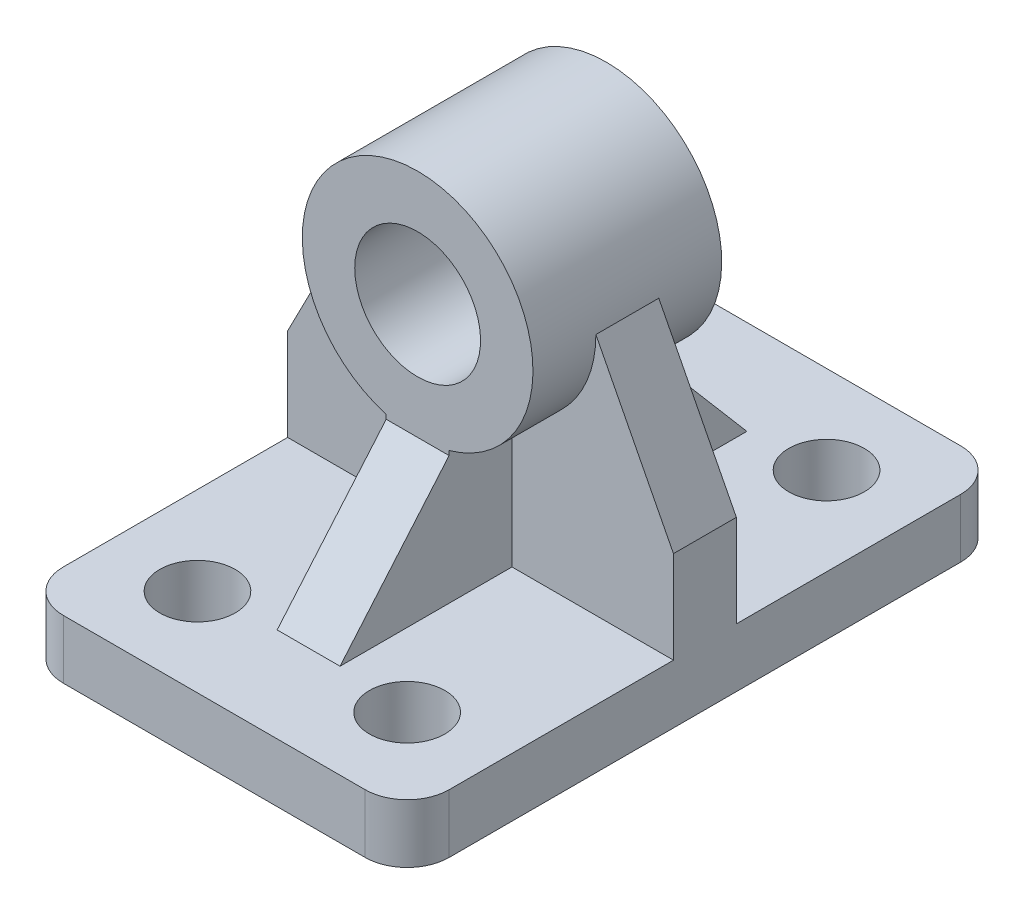
ISO-10303-21;
HEADER;
FILE_DESCRIPTION(('STEP AP214'),'2;1');
FILE_NAME('part.step','',(''),(''),'','','');
FILE_SCHEMA(('AUTOMOTIVE_DESIGN { 1 0 10303 214 1 1 1 1 }'));
ENDSEC;
DATA;
#1=APPLICATION_CONTEXT('core data for automotive mechanical design processes');
#2=APPLICATION_PROTOCOL_DEFINITION('international standard','automotive_design',2000,#1);
#3=PRODUCT_CONTEXT('',#1,'mechanical');
#4=PRODUCT('Part','Part','',(#3));
#5=PRODUCT_RELATED_PRODUCT_CATEGORY('part','',(#4));
#6=PRODUCT_DEFINITION_FORMATION('','',#4);
#7=PRODUCT_DEFINITION_CONTEXT('part definition',#1,'design');
#8=PRODUCT_DEFINITION('design','',#6,#7);
#9=PRODUCT_DEFINITION_SHAPE('','',#8);
#10=(LENGTH_UNIT() NAMED_UNIT(*) SI_UNIT(.MILLI.,.METRE.));
#11=(NAMED_UNIT(*) PLANE_ANGLE_UNIT() SI_UNIT($,.RADIAN.));
#12=(NAMED_UNIT(*) SI_UNIT($,.STERADIAN.) SOLID_ANGLE_UNIT());
#13=UNCERTAINTY_MEASURE_WITH_UNIT(LENGTH_MEASURE(1.E-05),#10,'distance_accuracy_value','');
#14=(GEOMETRIC_REPRESENTATION_CONTEXT(3) GLOBAL_UNCERTAINTY_ASSIGNED_CONTEXT((#13)) GLOBAL_UNIT_ASSIGNED_CONTEXT((#10,
#11,#12)) REPRESENTATION_CONTEXT('',''));
#15=CARTESIAN_POINT('',(0.,0.,0.));
#16=DIRECTION('',(0.,0.,1.));
#17=DIRECTION('',(1.,0.,0.));
#18=AXIS2_PLACEMENT_3D('',#15,#16,#17);
#19=CARTESIAN_POINT('',(-111.401360544218,100.,-85.360544217687));
#20=DIRECTION('',(1.,0.,0.));
#21=DIRECTION('',(0.,0.,-1.));
#22=AXIS2_PLACEMENT_3D('',#19,#20,#21);
#23=PLANE('',#22);
#24=DIRECTION('',(0.,0.,-1.));
#25=VECTOR('',#24,1.);
#26=CARTESIAN_POINT('',(-111.401360544218,14.,-85.3605442176871));
#27=LINE('',#26,#25);
#28=CARTESIAN_POINT('',(-111.401360544218,14.,-21.860544217687));
#29=VERTEX_POINT('',#28);
#30=CARTESIAN_POINT('',(-111.401360544218,14.,-75.360544217687));
#31=VERTEX_POINT('',#30);
#32=EDGE_CURVE('E396',#29,#31,#27,.T.);
#33=ORIENTED_EDGE('',*,*,#32,.T.);
#34=DIRECTION('',(0.,-1.,0.));
#35=VECTOR('',#34,1.);
#36=CARTESIAN_POINT('',(-111.401360544218,100.,-75.360544217687));
#37=LINE('',#36,#35);
#38=CARTESIAN_POINT('',(-111.401360544218,0.,-75.360544217687));
#39=VERTEX_POINT('',#38);
#40=EDGE_CURVE('E322',#31,#39,#37,.T.);
#41=ORIENTED_EDGE('',*,*,#40,.T.);
#42=DIRECTION('',(0.,0.,1.));
#43=VECTOR('',#42,1.);
#44=CARTESIAN_POINT('',(-111.401360544218,0.,-85.360544217687));
#45=LINE('',#44,#43);
#46=CARTESIAN_POINT('',(-111.401360544218,0.,46.6394557823129));
#47=VERTEX_POINT('',#46);
#48=EDGE_CURVE('E278',#39,#47,#45,.T.);
#49=ORIENTED_EDGE('',*,*,#48,.T.);
#50=DIRECTION('',(0.,-1.,0.));
#51=VECTOR('',#50,1.);
#52=CARTESIAN_POINT('',(-111.401360544218,100.,46.6394557823129));
#53=LINE('',#52,#51);
#54=CARTESIAN_POINT('',(-111.401360544218,14.,46.6394557823129));
#55=VERTEX_POINT('',#54);
#56=EDGE_CURVE('E319',#47,#55,#53,.F.);
#57=ORIENTED_EDGE('',*,*,#56,.T.);
#58=DIRECTION('',(0.,0.,-1.));
#59=VECTOR('',#58,1.);
#60=CARTESIAN_POINT('',(-111.401360544218,14.,56.639455782313));
#61=LINE('',#60,#59);
#62=CARTESIAN_POINT('',(-111.401360544218,14.,-6.86054421768706));
#63=VERTEX_POINT('',#62);
#64=EDGE_CURVE('E379',#55,#63,#61,.T.);
#65=ORIENTED_EDGE('',*,*,#64,.T.);
#66=DIRECTION('',(0.,1.,0.));
#67=VECTOR('',#66,1.);
#68=CARTESIAN_POINT('',(-111.401360544218,0.,-6.86054421768706));
#69=LINE('',#68,#67);
#70=CARTESIAN_POINT('',(-111.401360544218,36.,-6.86054421768706));
#71=VERTEX_POINT('',#70);
#72=EDGE_CURVE('E465',#63,#71,#69,.T.);
#73=ORIENTED_EDGE('',*,*,#72,.T.);
#74=DIRECTION('',(0.,0.,1.));
#75=VECTOR('',#74,1.);
#76=CARTESIAN_POINT('',(-111.401360544218,36.,-85.360544217687));
#77=LINE('',#76,#75);
#78=CARTESIAN_POINT('',(-111.401360544218,36.,-21.860544217687));
#79=VERTEX_POINT('',#78);
#80=EDGE_CURVE('E254',#79,#71,#77,.T.);
#81=ORIENTED_EDGE('',*,*,#80,.F.);
#82=DIRECTION('',(0.,1.,0.));
#83=VECTOR('',#82,1.);
#84=CARTESIAN_POINT('',(-111.401360544218,0.,-21.860544217687));
#85=LINE('',#84,#83);
#86=EDGE_CURVE('E867',#29,#79,#85,.T.);
#87=ORIENTED_EDGE('',*,*,#86,.F.);
#88=EDGE_LOOP('',(#33,#41,#49,#57,#65,#73,#81,#87));
#89=FACE_BOUND('',#88,.T.);
#90=ADVANCED_FACE('F59',(#89),#23,.F.);
#91=CARTESIAN_POINT('',(-19.4013605442177,100.,-85.360544217687));
#92=DIRECTION('',(-1.,0.,0.));
#93=DIRECTION('',(0.,0.,1.));
#94=AXIS2_PLACEMENT_3D('',#91,#92,#93);
#95=PLANE('',#94);
#96=DIRECTION('',(0.,0.,-1.));
#97=VECTOR('',#96,1.);
#98=CARTESIAN_POINT('',(-19.4013605442177,0.,-85.360544217687));
#99=LINE('',#98,#97);
#100=CARTESIAN_POINT('',(-19.4013605442176,0.,46.6394557823129));
#101=VERTEX_POINT('',#100);
#102=CARTESIAN_POINT('',(-19.4013605442177,0.,-75.360544217687));
#103=VERTEX_POINT('',#102);
#104=EDGE_CURVE('E285',#101,#103,#99,.T.);
#105=ORIENTED_EDGE('',*,*,#104,.T.);
#106=DIRECTION('',(0.,-1.,0.));
#107=VECTOR('',#106,1.);
#108=CARTESIAN_POINT('',(-19.4013605442177,100.,-75.360544217687));
#109=LINE('',#108,#107);
#110=CARTESIAN_POINT('',(-19.4013605442177,14.,-75.360544217687));
#111=VERTEX_POINT('',#110);
#112=EDGE_CURVE('E355',#103,#111,#109,.F.);
#113=ORIENTED_EDGE('',*,*,#112,.T.);
#114=DIRECTION('',(0.,0.,-1.));
#115=VECTOR('',#114,1.);
#116=CARTESIAN_POINT('',(-19.4013605442177,14.,-85.3605442176871));
#117=LINE('',#116,#115);
#118=CARTESIAN_POINT('',(-19.4013605442177,14.,-21.860544217687));
#119=VERTEX_POINT('',#118);
#120=EDGE_CURVE('E413',#119,#111,#117,.T.);
#121=ORIENTED_EDGE('',*,*,#120,.F.);
#122=DIRECTION('',(0.,1.,0.));
#123=VECTOR('',#122,1.);
#124=CARTESIAN_POINT('',(-19.4013605442177,0.,-21.860544217687));
#125=LINE('',#124,#123);
#126=CARTESIAN_POINT('',(-19.4013605442177,36.,-21.860544217687));
#127=VERTEX_POINT('',#126);
#128=EDGE_CURVE('E243',#119,#127,#125,.T.);
#129=ORIENTED_EDGE('',*,*,#128,.T.);
#130=DIRECTION('',(0.,0.,1.));
#131=VECTOR('',#130,1.);
#132=CARTESIAN_POINT('',(-19.4013605442176,36.,-85.360544217687));
#133=LINE('',#132,#131);
#134=CARTESIAN_POINT('',(-19.4013605442176,36.,-6.86054421768706));
#135=VERTEX_POINT('',#134);
#136=EDGE_CURVE('E241',#127,#135,#133,.T.);
#137=ORIENTED_EDGE('',*,*,#136,.T.);
#138=DIRECTION('',(0.,1.,0.));
#139=VECTOR('',#138,1.);
#140=CARTESIAN_POINT('',(-19.4013605442176,0.,-6.86054421768706));
#141=LINE('',#140,#139);
#142=CARTESIAN_POINT('',(-19.4013605442176,14.,-6.86054421768706));
#143=VERTEX_POINT('',#142);
#144=EDGE_CURVE('E377',#143,#135,#141,.T.);
#145=ORIENTED_EDGE('',*,*,#144,.F.);
#146=DIRECTION('',(0.,0.,-1.));
#147=VECTOR('',#146,1.);
#148=CARTESIAN_POINT('',(-19.4013605442176,14.,56.6394557823129));
#149=LINE('',#148,#147);
#150=CARTESIAN_POINT('',(-19.4013605442176,14.,46.6394557823129));
#151=VERTEX_POINT('',#150);
#152=EDGE_CURVE('E367',#151,#143,#149,.T.);
#153=ORIENTED_EDGE('',*,*,#152,.F.);
#154=DIRECTION('',(0.,-1.,0.));
#155=VECTOR('',#154,1.);
#156=CARTESIAN_POINT('',(-19.4013605442176,100.,46.6394557823129));
#157=LINE('',#156,#155);
#158=EDGE_CURVE('E351',#151,#101,#157,.T.);
#159=ORIENTED_EDGE('',*,*,#158,.T.);
#160=EDGE_LOOP('',(#105,#113,#121,#129,#137,#145,#153,#159));
#161=FACE_BOUND('',#160,.T.);
#162=ADVANCED_FACE('F374',(#161),#95,.F.);
#163=CARTESIAN_POINT('',(-102.763414170796,52.8089767266589,-85.360544217687));
#164=DIRECTION('',(-0.889431307788423,0.457068866502384,0.));
#165=DIRECTION('',(-0.457068866502385,-0.889431307788424,0.));
#166=AXIS2_PLACEMENT_3D('',#163,#164,#165);
#167=PLANE('',#166);
#168=DIRECTION('',(0.,0.,1.));
#169=VECTOR('',#168,1.);
#170=CARTESIAN_POINT('',(-92.9013605442177,72.,-85.360544217687));
#171=LINE('',#170,#169);
#172=CARTESIAN_POINT('',(-92.9013605442176,72.,-21.860544217687));
#173=VERTEX_POINT('',#172);
#174=CARTESIAN_POINT('',(-92.9013605442176,72.,-6.86054421768706));
#175=VERTEX_POINT('',#174);
#176=EDGE_CURVE('E266',#173,#175,#171,.T.);
#177=ORIENTED_EDGE('',*,*,#176,.F.);
#178=DIRECTION('',(0.457068866502385,0.889431307788424,0.));
#179=VECTOR('',#178,1.);
#180=CARTESIAN_POINT('',(-102.763414170796,52.8089767266589,-21.860544217687));
#181=LINE('',#180,#179);
#182=EDGE_CURVE('E458',#79,#173,#181,.T.);
#183=ORIENTED_EDGE('',*,*,#182,.F.);
#184=ORIENTED_EDGE('',*,*,#80,.T.);
#185=DIRECTION('',(0.457068866502385,0.889431307788424,0.));
#186=VECTOR('',#185,1.);
#187=CARTESIAN_POINT('',(-102.763414170796,52.808976726659,-6.86054421768706));
#188=LINE('',#187,#186);
#189=EDGE_CURVE('E456',#71,#175,#188,.T.);
#190=ORIENTED_EDGE('',*,*,#189,.T.);
#191=EDGE_LOOP('',(#177,#183,#184,#190));
#192=FACE_BOUND('',#191,.T.);
#193=ADVANCED_FACE('F455',(#192),#167,.T.);
#194=CARTESIAN_POINT('',(-0.713055556420601,-0.366431327605031,-85.360544217687));
#195=DIRECTION('',(0.889431307788423,0.457068866502385,0.));
#196=DIRECTION('',(-0.457068866502385,0.889431307788424,0.));
#197=AXIS2_PLACEMENT_3D('',#194,#195,#196);
#198=PLANE('',#197);
#199=ORIENTED_EDGE('',*,*,#136,.F.);
#200=DIRECTION('',(-0.457068866502385,0.889431307788424,0.));
#201=VECTOR('',#200,1.);
#202=CARTESIAN_POINT('',(-0.713055556420604,-0.366431327605033,-21.860544217687));
#203=LINE('',#202,#201);
#204=CARTESIAN_POINT('',(-37.9013605442177,72.,-21.860544217687));
#205=VERTEX_POINT('',#204);
#206=EDGE_CURVE('E224',#127,#205,#203,.T.);
#207=ORIENTED_EDGE('',*,*,#206,.T.);
#208=DIRECTION('',(0.,0.,1.));
#209=VECTOR('',#208,1.);
#210=CARTESIAN_POINT('',(-37.9013605442177,72.,-85.360544217687));
#211=LINE('',#210,#209);
#212=CARTESIAN_POINT('',(-37.9013605442177,72.,-6.86054421768706));
#213=VERTEX_POINT('',#212);
#214=EDGE_CURVE('E239',#205,#213,#211,.T.);
#215=ORIENTED_EDGE('',*,*,#214,.T.);
#216=DIRECTION('',(-0.457068866502385,0.889431307788423,0.));
#217=VECTOR('',#216,1.);
#218=CARTESIAN_POINT('',(-0.713055556420598,-0.36643132760503,-6.86054421768706));
#219=LINE('',#218,#217);
#220=EDGE_CURVE('E501',#135,#213,#219,.T.);
#221=ORIENTED_EDGE('',*,*,#220,.F.);
#222=EDGE_LOOP('',(#199,#207,#215,#221));
#223=FACE_BOUND('',#222,.T.);
#224=ADVANCED_FACE('F237',(#223),#198,.T.);
#225=CARTESIAN_POINT('',(-90.4013605442177,100.,-64.360544217687));
#226=DIRECTION('',(0.,-1.,0.));
#227=DIRECTION('',(0.,0.,-1.));
#228=AXIS2_PLACEMENT_3D('',#225,#226,#227);
#229=CYLINDRICAL_SURFACE('',#228,8.99999999999999);
#230=CARTESIAN_POINT('',(-90.4013605442177,0.,-64.360544217687));
#231=DIRECTION('',(0.,1.,0.));
#232=DIRECTION('',(0.,0.,1.));
#233=AXIS2_PLACEMENT_3D('',#230,#231,#232);
#234=CIRCLE('',#233,8.99999999999999);
#235=CARTESIAN_POINT('',(-90.4013605442177,0.,-55.360544217687));
#236=VERTEX_POINT('',#235);
#237=EDGE_CURVE('E274',#236,#236,#234,.T.);
#238=ORIENTED_EDGE('',*,*,#237,.F.);
#239=EDGE_LOOP('',(#238));
#240=FACE_BOUND('',#239,.T.);
#241=CARTESIAN_POINT('',(-90.4013605442177,14.,-64.360544217687));
#242=DIRECTION('',(0.,-1.,0.));
#243=DIRECTION('',(0.,0.,-1.));
#244=AXIS2_PLACEMENT_3D('',#241,#242,#243);
#245=CIRCLE('',#244,8.99999999999999);
#246=CARTESIAN_POINT('',(-90.4013605442177,14.,-73.360544217687));
#247=VERTEX_POINT('',#246);
#248=EDGE_CURVE('E250',#247,#247,#245,.T.);
#249=ORIENTED_EDGE('',*,*,#248,.F.);
#250=EDGE_LOOP('',(#249));
#251=FACE_BOUND('',#250,.T.);
#252=ADVANCED_FACE('F645',(#240,#251),#229,.F.);
#253=CARTESIAN_POINT('',(-40.4013605442177,100.,-64.360544217687));
#254=DIRECTION('',(0.,-1.,0.));
#255=DIRECTION('',(0.,0.,-1.));
#256=AXIS2_PLACEMENT_3D('',#253,#254,#255);
#257=CYLINDRICAL_SURFACE('',#256,9.00000000000001);
#258=CARTESIAN_POINT('',(-40.4013605442177,0.,-64.360544217687));
#259=DIRECTION('',(0.,1.,0.));
#260=DIRECTION('',(0.,0.,1.));
#261=AXIS2_PLACEMENT_3D('',#258,#259,#260);
#262=CIRCLE('',#261,9.00000000000001);
#263=CARTESIAN_POINT('',(-40.4013605442177,0.,-55.360544217687));
#264=VERTEX_POINT('',#263);
#265=EDGE_CURVE('E265',#264,#264,#262,.T.);
#266=ORIENTED_EDGE('',*,*,#265,.F.);
#267=EDGE_LOOP('',(#266));
#268=FACE_BOUND('',#267,.T.);
#269=CARTESIAN_POINT('',(-40.4013605442177,14.,-64.360544217687));
#270=DIRECTION('',(0.,-1.,0.));
#271=DIRECTION('',(0.,0.,-1.));
#272=AXIS2_PLACEMENT_3D('',#269,#270,#271);
#273=CIRCLE('',#272,9.00000000000001);
#274=CARTESIAN_POINT('',(-40.4013605442177,14.,-73.360544217687));
#275=VERTEX_POINT('',#274);
#276=EDGE_CURVE('E308',#275,#275,#273,.T.);
#277=ORIENTED_EDGE('',*,*,#276,.F.);
#278=EDGE_LOOP('',(#277));
#279=FACE_BOUND('',#278,.T.);
#280=ADVANCED_FACE('F652',(#268,#279),#257,.F.);
#281=CARTESIAN_POINT('',(-111.401360544218,44.5,-36.8605442176871));
#282=DIRECTION('',(0.,0.,1.));
#283=DIRECTION('',(0.,-1.,0.));
#284=AXIS2_PLACEMENT_3D('',#281,#282,#283);
#285=PLANE('',#284);
#286=CARTESIAN_POINT('',(-65.4013605442177,72.,-36.8605442176871));
#287=DIRECTION('',(0.,0.,1.));
#288=DIRECTION('',(0.,-1.,0.));
#289=AXIS2_PLACEMENT_3D('',#286,#287,#288);
#290=CIRCLE('',#289,15.);
#291=CARTESIAN_POINT('',(-65.4013605442177,57.,-36.8605442176871));
#292=VERTEX_POINT('',#291);
#293=EDGE_CURVE('E294',#292,#292,#290,.F.);
#294=ORIENTED_EDGE('',*,*,#293,.F.);
#295=EDGE_LOOP('',(#294));
#296=FACE_BOUND('',#295,.T.);
#297=CARTESIAN_POINT('',(-65.4013605442177,72.,-36.8605442176871));
#298=DIRECTION('',(0.,0.,1.));
#299=DIRECTION('',(0.,-1.,0.));
#300=AXIS2_PLACEMENT_3D('',#297,#298,#299);
#301=CIRCLE('',#300,27.5);
#302=CARTESIAN_POINT('',(-72.9013605442177,45.5424868893541,-36.8605442176871));
#303=VERTEX_POINT('',#302);
#304=CARTESIAN_POINT('',(-57.9013605442177,45.5424868893541,-36.8605442176871));
#305=VERTEX_POINT('',#304);
#306=EDGE_CURVE('E298',#303,#305,#301,.F.);
#307=ORIENTED_EDGE('',*,*,#306,.T.);
#308=DIRECTION('',(0.,1.,0.));
#309=VECTOR('',#308,1.);
#310=CARTESIAN_POINT('',(-57.9013605442177,44.5,-36.8605442176871));
#311=LINE('',#310,#309);
#312=CARTESIAN_POINT('',(-57.9013605442177,44.5,-36.8605442176871));
#313=VERTEX_POINT('',#312);
#314=EDGE_CURVE('E492',#313,#305,#311,.T.);
#315=ORIENTED_EDGE('',*,*,#314,.F.);
#316=DIRECTION('',(1.,0.,0.));
#317=VECTOR('',#316,1.);
#318=CARTESIAN_POINT('',(-111.401360544218,44.5,-36.8605442176871));
#319=LINE('',#318,#317);
#320=CARTESIAN_POINT('',(-72.9013605442177,44.5,-36.8605442176871));
#321=VERTEX_POINT('',#320);
#322=EDGE_CURVE('E434',#321,#313,#319,.T.);
#323=ORIENTED_EDGE('',*,*,#322,.F.);
#324=DIRECTION('',(0.,1.,0.));
#325=VECTOR('',#324,1.);
#326=CARTESIAN_POINT('',(-72.9013605442177,44.5,-36.8605442176871));
#327=LINE('',#326,#325);
#328=EDGE_CURVE('E841',#321,#303,#327,.T.);
#329=ORIENTED_EDGE('',*,*,#328,.T.);
#330=EDGE_LOOP('',(#307,#315,#323,#329));
#331=FACE_BOUND('',#330,.T.);
#332=ADVANCED_FACE('F660',(#296,#331),#285,.F.);
#333=CARTESIAN_POINT('',(-111.401360544218,14.,-62.860544217687));
#334=DIRECTION('',(0.,-0.648734176013878,0.761015091093202));
#335=DIRECTION('',(0.,-0.761015091093203,-0.648734176013878));
#336=AXIS2_PLACEMENT_3D('',#333,#334,#335);
#337=PLANE('',#336);
#338=DIRECTION('',(0.,0.761015091093203,0.648734176013878));
#339=VECTOR('',#338,1.);
#340=CARTESIAN_POINT('',(-57.9013605442177,14.,-62.860544217687));
#341=LINE('',#340,#339);
#342=CARTESIAN_POINT('',(-57.9013605442177,14.,-62.860544217687));
#343=VERTEX_POINT('',#342);
#344=EDGE_CURVE('E316',#343,#313,#341,.T.);
#345=ORIENTED_EDGE('',*,*,#344,.F.);
#346=DIRECTION('',(1.,0.,0.));
#347=VECTOR('',#346,1.);
#348=CARTESIAN_POINT('',(-111.401360544218,14.,-62.860544217687));
#349=LINE('',#348,#347);
#350=CARTESIAN_POINT('',(-72.9013605442177,14.,-62.860544217687));
#351=VERTEX_POINT('',#350);
#352=EDGE_CURVE('E380',#351,#343,#349,.T.);
#353=ORIENTED_EDGE('',*,*,#352,.F.);
#354=DIRECTION('',(0.,0.761015091093203,0.648734176013878));
#355=VECTOR('',#354,1.);
#356=CARTESIAN_POINT('',(-72.9013605442177,14.,-62.860544217687));
#357=LINE('',#356,#355);
#358=EDGE_CURVE('E312',#351,#321,#357,.T.);
#359=ORIENTED_EDGE('',*,*,#358,.T.);
#360=ORIENTED_EDGE('',*,*,#322,.T.);
#361=EDGE_LOOP('',(#345,#353,#359,#360));
#362=FACE_BOUND('',#361,.T.);
#363=ADVANCED_FACE('F668',(#362),#337,.F.);
#364=CARTESIAN_POINT('',(-90.4013605442176,100.,35.6394557823129));
#365=DIRECTION('',(0.,-1.,0.));
#366=DIRECTION('',(0.,0.,-1.));
#367=AXIS2_PLACEMENT_3D('',#364,#365,#366);
#368=CYLINDRICAL_SURFACE('',#367,9.);
#369=CARTESIAN_POINT('',(-90.4013605442176,0.,35.6394557823129));
#370=DIRECTION('',(0.,1.,0.));
#371=DIRECTION('',(0.,0.,1.));
#372=AXIS2_PLACEMENT_3D('',#369,#370,#371);
#373=CIRCLE('',#372,9.);
#374=CARTESIAN_POINT('',(-90.4013605442176,0.,44.6394557823129));
#375=VERTEX_POINT('',#374);
#376=EDGE_CURVE('E270',#375,#375,#373,.T.);
#377=ORIENTED_EDGE('',*,*,#376,.F.);
#378=EDGE_LOOP('',(#377));
#379=FACE_BOUND('',#378,.T.);
#380=CARTESIAN_POINT('',(-90.4013605442176,14.,35.6394557823129));
#381=DIRECTION('',(0.,-1.,0.));
#382=DIRECTION('',(0.,0.,-1.));
#383=AXIS2_PLACEMENT_3D('',#380,#381,#382);
#384=CIRCLE('',#383,9.);
#385=CARTESIAN_POINT('',(-90.4013605442176,14.,26.6394557823129));
#386=VERTEX_POINT('',#385);
#387=EDGE_CURVE('E257',#386,#386,#384,.T.);
#388=ORIENTED_EDGE('',*,*,#387,.F.);
#389=EDGE_LOOP('',(#388));
#390=FACE_BOUND('',#389,.T.);
#391=ADVANCED_FACE('F676',(#379,#390),#368,.F.);
#392=CARTESIAN_POINT('',(-40.4013605442177,100.,35.6394557823129));
#393=DIRECTION('',(0.,-1.,0.));
#394=DIRECTION('',(0.,0.,-1.));
#395=AXIS2_PLACEMENT_3D('',#392,#393,#394);
#396=CYLINDRICAL_SURFACE('',#395,9.);
#397=CARTESIAN_POINT('',(-40.4013605442177,0.,35.6394557823129));
#398=DIRECTION('',(0.,1.,0.));
#399=DIRECTION('',(0.,0.,1.));
#400=AXIS2_PLACEMENT_3D('',#397,#398,#399);
#401=CIRCLE('',#400,9.);
#402=CARTESIAN_POINT('',(-40.4013605442177,0.,44.6394557823129));
#403=VERTEX_POINT('',#402);
#404=EDGE_CURVE('E261',#403,#403,#401,.T.);
#405=ORIENTED_EDGE('',*,*,#404,.F.);
#406=EDGE_LOOP('',(#405));
#407=FACE_BOUND('',#406,.T.);
#408=CARTESIAN_POINT('',(-40.4013605442177,14.,35.6394557823129));
#409=DIRECTION('',(0.,-1.,0.));
#410=DIRECTION('',(0.,0.,-1.));
#411=AXIS2_PLACEMENT_3D('',#408,#409,#410);
#412=CIRCLE('',#411,9.);
#413=CARTESIAN_POINT('',(-40.4013605442177,14.,26.6394557823129));
#414=VERTEX_POINT('',#413);
#415=EDGE_CURVE('E293',#414,#414,#412,.T.);
#416=ORIENTED_EDGE('',*,*,#415,.F.);
#417=EDGE_LOOP('',(#416));
#418=FACE_BOUND('',#417,.T.);
#419=ADVANCED_FACE('F685',(#407,#418),#396,.F.);
#420=CARTESIAN_POINT('',(-111.401360544218,44.5,8.13945578231296));
#421=DIRECTION('',(0.,0.,-1.));
#422=DIRECTION('',(-1.,0.,0.));
#423=AXIS2_PLACEMENT_3D('',#420,#421,#422);
#424=PLANE('',#423);
#425=CARTESIAN_POINT('',(-65.4013605442177,72.,8.13945578231295));
#426=DIRECTION('',(0.,0.,-1.));
#427=DIRECTION('',(-1.,0.,0.));
#428=AXIS2_PLACEMENT_3D('',#425,#426,#427);
#429=CIRCLE('',#428,15.);
#430=CARTESIAN_POINT('',(-80.4013605442177,72.,8.13945578231296));
#431=VERTEX_POINT('',#430);
#432=EDGE_CURVE('E300',#431,#431,#429,.F.);
#433=ORIENTED_EDGE('',*,*,#432,.F.);
#434=EDGE_LOOP('',(#433));
#435=FACE_BOUND('',#434,.T.);
#436=CARTESIAN_POINT('',(-65.4013605442177,72.,8.13945578231295));
#437=DIRECTION('',(0.,0.,-1.));
#438=DIRECTION('',(-1.,0.,0.));
#439=AXIS2_PLACEMENT_3D('',#436,#437,#438);
#440=CIRCLE('',#439,27.5);
#441=CARTESIAN_POINT('',(-57.9013605442177,45.5424868893541,8.13945578231295));
#442=VERTEX_POINT('',#441);
#443=CARTESIAN_POINT('',(-72.9013605442177,45.5424868893541,8.13945578231295));
#444=VERTEX_POINT('',#443);
#445=EDGE_CURVE('E304',#442,#444,#440,.F.);
#446=ORIENTED_EDGE('',*,*,#445,.T.);
#447=DIRECTION('',(0.,1.,0.));
#448=VECTOR('',#447,1.);
#449=CARTESIAN_POINT('',(-72.9013605442176,44.5,8.13945578231295));
#450=LINE('',#449,#448);
#451=CARTESIAN_POINT('',(-72.9013605442177,44.5,8.13945578231295));
#452=VERTEX_POINT('',#451);
#453=EDGE_CURVE('E421',#452,#444,#450,.T.);
#454=ORIENTED_EDGE('',*,*,#453,.F.);
#455=DIRECTION('',(1.,0.,0.));
#456=VECTOR('',#455,1.);
#457=CARTESIAN_POINT('',(-111.401360544218,44.5,8.13945578231296));
#458=LINE('',#457,#456);
#459=CARTESIAN_POINT('',(-57.9013605442177,44.5,8.13945578231295));
#460=VERTEX_POINT('',#459);
#461=EDGE_CURVE('E299',#452,#460,#458,.T.);
#462=ORIENTED_EDGE('',*,*,#461,.T.);
#463=DIRECTION('',(0.,1.,0.));
#464=VECTOR('',#463,1.);
#465=CARTESIAN_POINT('',(-57.9013605442177,44.5,8.13945578231295));
#466=LINE('',#465,#464);
#467=EDGE_CURVE('E515',#460,#442,#466,.T.);
#468=ORIENTED_EDGE('',*,*,#467,.T.);
#469=EDGE_LOOP('',(#446,#454,#462,#468));
#470=FACE_BOUND('',#469,.T.);
#471=ADVANCED_FACE('F694',(#435,#470),#424,.F.);
#472=CARTESIAN_POINT('',(-111.401360544218,14.,34.1394557823129));
#473=DIRECTION('',(0.,-0.648734176013878,-0.761015091093203));
#474=DIRECTION('',(0.,0.761015091093203,-0.648734176013878));
#475=AXIS2_PLACEMENT_3D('',#472,#473,#474);
#476=PLANE('',#475);
#477=DIRECTION('',(0.,0.761015091093203,-0.648734176013878));
#478=VECTOR('',#477,1.);
#479=CARTESIAN_POINT('',(-72.9013605442177,14.,34.139455782313));
#480=LINE('',#479,#478);
#481=CARTESIAN_POINT('',(-72.9013605442177,14.,34.1394557823129));
#482=VERTEX_POINT('',#481);
#483=EDGE_CURVE('E427',#482,#452,#480,.T.);
#484=ORIENTED_EDGE('',*,*,#483,.F.);
#485=DIRECTION('',(1.,0.,0.));
#486=VECTOR('',#485,1.);
#487=CARTESIAN_POINT('',(-111.401360544218,14.,34.1394557823129));
#488=LINE('',#487,#486);
#489=CARTESIAN_POINT('',(-57.9013605442177,14.,34.1394557823129));
#490=VERTEX_POINT('',#489);
#491=EDGE_CURVE('E526',#482,#490,#488,.T.);
#492=ORIENTED_EDGE('',*,*,#491,.T.);
#493=DIRECTION('',(0.,0.761015091093203,-0.648734176013878));
#494=VECTOR('',#493,1.);
#495=CARTESIAN_POINT('',(-57.9013605442176,14.,34.1394557823129));
#496=LINE('',#495,#494);
#497=EDGE_CURVE('E486',#490,#460,#496,.T.);
#498=ORIENTED_EDGE('',*,*,#497,.T.);
#499=ORIENTED_EDGE('',*,*,#461,.F.);
#500=EDGE_LOOP('',(#484,#492,#498,#499));
#501=FACE_BOUND('',#500,.T.);
#502=ADVANCED_FACE('F533',(#501),#476,.F.);
#503=CARTESIAN_POINT('',(-111.401360544218,100.,56.6394557823129));
#504=DIRECTION('',(0.,0.,-1.));
#505=DIRECTION('',(-1.,0.,0.));
#506=AXIS2_PLACEMENT_3D('',#503,#504,#505);
#507=PLANE('',#506);
#508=DIRECTION('',(1.,0.,0.));
#509=VECTOR('',#508,1.);
#510=CARTESIAN_POINT('',(-111.401360544218,14.,56.639455782313));
#511=LINE('',#510,#509);
#512=CARTESIAN_POINT('',(-101.401360544218,14.,56.639455782313));
#513=VERTEX_POINT('',#512);
#514=CARTESIAN_POINT('',(-29.4013605442177,14.,56.6394557823129));
#515=VERTEX_POINT('',#514);
#516=EDGE_CURVE('E369',#513,#515,#511,.T.);
#517=ORIENTED_EDGE('',*,*,#516,.F.);
#518=DIRECTION('',(0.,-1.,0.));
#519=VECTOR('',#518,1.);
#520=CARTESIAN_POINT('',(-101.401360544218,100.,56.6394557823129));
#521=LINE('',#520,#519);
#522=CARTESIAN_POINT('',(-101.401360544218,0.,56.6394557823129));
#523=VERTEX_POINT('',#522);
#524=EDGE_CURVE('E360',#513,#523,#521,.T.);
#525=ORIENTED_EDGE('',*,*,#524,.T.);
#526=DIRECTION('',(1.,0.,0.));
#527=VECTOR('',#526,1.);
#528=CARTESIAN_POINT('',(-111.401360544218,0.,56.6394557823129));
#529=LINE('',#528,#527);
#530=CARTESIAN_POINT('',(-29.4013605442176,0.,56.6394557823129));
#531=VERTEX_POINT('',#530);
#532=EDGE_CURVE('E282',#523,#531,#529,.T.);
#533=ORIENTED_EDGE('',*,*,#532,.T.);
#534=DIRECTION('',(0.,-1.,0.));
#535=VECTOR('',#534,1.);
#536=CARTESIAN_POINT('',(-29.4013605442176,100.,56.6394557823129));
#537=LINE('',#536,#535);
#538=EDGE_CURVE('E75',#531,#515,#537,.F.);
#539=ORIENTED_EDGE('',*,*,#538,.T.);
#540=EDGE_LOOP('',(#517,#525,#533,#539));
#541=FACE_BOUND('',#540,.T.);
#542=ADVANCED_FACE('F387',(#541),#507,.F.);
#543=CARTESIAN_POINT('',(-111.401360544218,100.,-85.360544217687));
#544=DIRECTION('',(0.,0.,1.));
#545=DIRECTION('',(1.,0.,0.));
#546=AXIS2_PLACEMENT_3D('',#543,#544,#545);
#547=PLANE('',#546);
#548=DIRECTION('',(-1.,0.,0.));
#549=VECTOR('',#548,1.);
#550=CARTESIAN_POINT('',(-111.401360544218,0.,-85.360544217687));
#551=LINE('',#550,#549);
#552=CARTESIAN_POINT('',(-29.4013605442177,0.,-85.360544217687));
#553=VERTEX_POINT('',#552);
#554=CARTESIAN_POINT('',(-101.401360544218,0.,-85.360544217687));
#555=VERTEX_POINT('',#554);
#556=EDGE_CURVE('E289',#553,#555,#551,.T.);
#557=ORIENTED_EDGE('',*,*,#556,.T.);
#558=DIRECTION('',(0.,-1.,0.));
#559=VECTOR('',#558,1.);
#560=CARTESIAN_POINT('',(-101.401360544218,100.,-85.360544217687));
#561=LINE('',#560,#559);
#562=CARTESIAN_POINT('',(-101.401360544218,14.,-85.3605442176871));
#563=VERTEX_POINT('',#562);
#564=EDGE_CURVE('E342',#555,#563,#561,.F.);
#565=ORIENTED_EDGE('',*,*,#564,.T.);
#566=DIRECTION('',(1.,0.,0.));
#567=VECTOR('',#566,1.);
#568=CARTESIAN_POINT('',(-111.401360544218,14.,-85.3605442176871));
#569=LINE('',#568,#567);
#570=CARTESIAN_POINT('',(-29.4013605442177,14.,-85.3605442176871));
#571=VERTEX_POINT('',#570);
#572=EDGE_CURVE('E407',#563,#571,#569,.T.);
#573=ORIENTED_EDGE('',*,*,#572,.T.);
#574=DIRECTION('',(0.,-1.,0.));
#575=VECTOR('',#574,1.);
#576=CARTESIAN_POINT('',(-29.4013605442177,100.,-85.360544217687));
#577=LINE('',#576,#575);
#578=EDGE_CURVE('E338',#571,#553,#577,.T.);
#579=ORIENTED_EDGE('',*,*,#578,.T.);
#580=EDGE_LOOP('',(#557,#565,#573,#579));
#581=FACE_BOUND('',#580,.T.);
#582=ADVANCED_FACE('F403',(#581),#547,.F.);
#583=CARTESIAN_POINT('',(0.,0.,0.));
#584=DIRECTION('',(0.,1.,0.));
#585=DIRECTION('',(0.,0.,1.));
#586=AXIS2_PLACEMENT_3D('',#583,#584,#585);
#587=PLANE('',#586);
#588=ORIENTED_EDGE('',*,*,#48,.F.);
#589=CARTESIAN_POINT('',(-101.401360544218,0.,-75.360544217687));
#590=DIRECTION('',(0.,1.,0.));
#591=DIRECTION('',(0.,0.,1.));
#592=AXIS2_PLACEMENT_3D('',#589,#590,#591);
#593=CIRCLE('',#592,10.);
#594=EDGE_CURVE('E335',#39,#555,#593,.F.);
#595=ORIENTED_EDGE('',*,*,#594,.T.);
#596=ORIENTED_EDGE('',*,*,#556,.F.);
#597=CARTESIAN_POINT('',(-29.4013605442177,0.,-75.360544217687));
#598=DIRECTION('',(0.,1.,0.));
#599=DIRECTION('',(0.,0.,1.));
#600=AXIS2_PLACEMENT_3D('',#597,#598,#599);
#601=CIRCLE('',#600,10.);
#602=EDGE_CURVE('E332',#553,#103,#601,.F.);
#603=ORIENTED_EDGE('',*,*,#602,.T.);
#604=ORIENTED_EDGE('',*,*,#104,.F.);
#605=CARTESIAN_POINT('',(-29.4013605442177,0.,46.6394557823129));
#606=DIRECTION('',(0.,1.,0.));
#607=DIRECTION('',(0.,0.,1.));
#608=AXIS2_PLACEMENT_3D('',#605,#606,#607);
#609=CIRCLE('',#608,10.);
#610=EDGE_CURVE('E326',#101,#531,#609,.F.);
#611=ORIENTED_EDGE('',*,*,#610,.T.);
#612=ORIENTED_EDGE('',*,*,#532,.F.);
#613=CARTESIAN_POINT('',(-101.401360544218,0.,46.6394557823129));
#614=DIRECTION('',(0.,1.,0.));
#615=DIRECTION('',(0.,0.,1.));
#616=AXIS2_PLACEMENT_3D('',#613,#614,#615);
#617=CIRCLE('',#616,10.);
#618=EDGE_CURVE('E329',#523,#47,#617,.F.);
#619=ORIENTED_EDGE('',*,*,#618,.T.);
#620=EDGE_LOOP('',(#588,#595,#596,#603,#604,#611,#612,#619));
#621=FACE_BOUND('',#620,.T.);
#622=ORIENTED_EDGE('',*,*,#237,.T.);
#623=EDGE_LOOP('',(#622));
#624=FACE_BOUND('',#623,.T.);
#625=ORIENTED_EDGE('',*,*,#376,.T.);
#626=EDGE_LOOP('',(#625));
#627=FACE_BOUND('',#626,.T.);
#628=ORIENTED_EDGE('',*,*,#265,.T.);
#629=EDGE_LOOP('',(#628));
#630=FACE_BOUND('',#629,.T.);
#631=ORIENTED_EDGE('',*,*,#404,.T.);
#632=EDGE_LOOP('',(#631));
#633=FACE_BOUND('',#632,.T.);
#634=ADVANCED_FACE('F385',(#621,#624,#627,#630,#633),#587,.F.);
#635=CARTESIAN_POINT('',(-65.4013605442177,72.,-85.360544217687));
#636=DIRECTION('',(0.,0.,1.));
#637=DIRECTION('',(1.,0.,0.));
#638=AXIS2_PLACEMENT_3D('',#635,#636,#637);
#639=CYLINDRICAL_SURFACE('',#638,27.5);
#640=ORIENTED_EDGE('',*,*,#445,.F.);
#641=DIRECTION('',(0.,0.,1.));
#642=VECTOR('',#641,1.);
#643=CARTESIAN_POINT('',(-57.9013605442177,45.5424868893541,-6.86054421768706));
#644=LINE('',#643,#642);
#645=CARTESIAN_POINT('',(-57.9013605442177,45.5424868893541,-6.86054421768706));
#646=VERTEX_POINT('',#645);
#647=EDGE_CURVE('E504',#646,#442,#644,.T.);
#648=ORIENTED_EDGE('',*,*,#647,.F.);
#649=CARTESIAN_POINT('',(-65.4013605442177,72.,-6.86054421768706));
#650=DIRECTION('',(0.,0.,1.));
#651=DIRECTION('',(1.,0.,0.));
#652=AXIS2_PLACEMENT_3D('',#649,#650,#651);
#653=CIRCLE('',#652,27.5);
#654=EDGE_CURVE('E247',#646,#213,#653,.T.);
#655=ORIENTED_EDGE('',*,*,#654,.T.);
#656=ORIENTED_EDGE('',*,*,#214,.F.);
#657=CARTESIAN_POINT('',(-65.4013605442177,72.,-21.860544217687));
#658=DIRECTION('',(0.,0.,-1.));
#659=DIRECTION('',(-1.,0.,0.));
#660=AXIS2_PLACEMENT_3D('',#657,#658,#659);
#661=CIRCLE('',#660,27.5);
#662=CARTESIAN_POINT('',(-57.9013605442177,45.5424868893541,-21.860544217687));
#663=VERTEX_POINT('',#662);
#664=EDGE_CURVE('E220',#205,#663,#661,.T.);
#665=ORIENTED_EDGE('',*,*,#664,.T.);
#666=DIRECTION('',(0.,0.,-1.));
#667=VECTOR('',#666,1.);
#668=CARTESIAN_POINT('',(-57.9013605442177,45.5424868893541,-21.860544217687));
#669=LINE('',#668,#667);
#670=EDGE_CURVE('E843',#663,#305,#669,.T.);
#671=ORIENTED_EDGE('',*,*,#670,.T.);
#672=ORIENTED_EDGE('',*,*,#306,.F.);
#673=DIRECTION('',(0.,0.,-1.));
#674=VECTOR('',#673,1.);
#675=CARTESIAN_POINT('',(-72.9013605442177,45.5424868893541,-21.860544217687));
#676=LINE('',#675,#674);
#677=CARTESIAN_POINT('',(-72.9013605442177,45.5424868893541,-21.860544217687));
#678=VERTEX_POINT('',#677);
#679=EDGE_CURVE('E872',#678,#303,#676,.T.);
#680=ORIENTED_EDGE('',*,*,#679,.F.);
#681=CARTESIAN_POINT('',(-65.4013605442177,72.,-21.860544217687));
#682=DIRECTION('',(0.,0.,-1.));
#683=DIRECTION('',(-1.,0.,0.));
#684=AXIS2_PLACEMENT_3D('',#681,#682,#683);
#685=CIRCLE('',#684,27.5);
#686=EDGE_CURVE('E857',#678,#173,#685,.T.);
#687=ORIENTED_EDGE('',*,*,#686,.T.);
#688=ORIENTED_EDGE('',*,*,#176,.T.);
#689=CARTESIAN_POINT('',(-65.4013605442177,72.,-6.86054421768706));
#690=DIRECTION('',(0.,0.,1.));
#691=DIRECTION('',(1.,0.,0.));
#692=AXIS2_PLACEMENT_3D('',#689,#690,#691);
#693=CIRCLE('',#692,27.5);
#694=CARTESIAN_POINT('',(-72.9013605442177,45.5424868893541,-6.86054421768706));
#695=VERTEX_POINT('',#694);
#696=EDGE_CURVE('E467',#175,#695,#693,.T.);
#697=ORIENTED_EDGE('',*,*,#696,.T.);
#698=DIRECTION('',(0.,0.,1.));
#699=VECTOR('',#698,1.);
#700=CARTESIAN_POINT('',(-72.9013605442177,45.5424868893541,-6.86054421768706));
#701=LINE('',#700,#699);
#702=EDGE_CURVE('E482',#695,#444,#701,.T.);
#703=ORIENTED_EDGE('',*,*,#702,.T.);
#704=EDGE_LOOP('',(#640,#648,#655,#656,#665,#671,#672,#680,#687,#688,#697,#703));
#705=FACE_BOUND('',#704,.T.);
#706=ADVANCED_FACE('F245',(#705),#639,.T.);
#707=CARTESIAN_POINT('',(-111.401360544218,14.,-85.3605442176871));
#708=DIRECTION('',(0.,-1.,0.));
#709=DIRECTION('',(0.,0.,-1.));
#710=AXIS2_PLACEMENT_3D('',#707,#708,#709);
#711=PLANE('',#710);
#712=ORIENTED_EDGE('',*,*,#572,.F.);
#713=CARTESIAN_POINT('',(-101.401360544218,14.,-75.360544217687));
#714=DIRECTION('',(0.,-1.,0.));
#715=DIRECTION('',(0.,0.,-1.));
#716=AXIS2_PLACEMENT_3D('',#713,#714,#715);
#717=CIRCLE('',#716,10.);
#718=EDGE_CURVE('E348',#563,#31,#717,.F.);
#719=ORIENTED_EDGE('',*,*,#718,.T.);
#720=ORIENTED_EDGE('',*,*,#32,.F.);
#721=DIRECTION('',(1.,0.,0.));
#722=VECTOR('',#721,1.);
#723=CARTESIAN_POINT('',(0.,14.,-21.860544217687));
#724=LINE('',#723,#722);
#725=CARTESIAN_POINT('',(-72.9013605442177,14.,-21.860544217687));
#726=VERTEX_POINT('',#725);
#727=EDGE_CURVE('E864',#29,#726,#724,.T.);
#728=ORIENTED_EDGE('',*,*,#727,.T.);
#729=DIRECTION('',(0.,0.,-1.));
#730=VECTOR('',#729,1.);
#731=CARTESIAN_POINT('',(-72.9013605442177,14.,-21.860544217687));
#732=LINE('',#731,#730);
#733=EDGE_CURVE('E233',#726,#351,#732,.T.);
#734=ORIENTED_EDGE('',*,*,#733,.T.);
#735=ORIENTED_EDGE('',*,*,#352,.T.);
#736=DIRECTION('',(0.,0.,-1.));
#737=VECTOR('',#736,1.);
#738=CARTESIAN_POINT('',(-57.9013605442177,14.,-21.860544217687));
#739=LINE('',#738,#737);
#740=CARTESIAN_POINT('',(-57.9013605442177,14.,-21.860544217687));
#741=VERTEX_POINT('',#740);
#742=EDGE_CURVE('E848',#741,#343,#739,.T.);
#743=ORIENTED_EDGE('',*,*,#742,.F.);
#744=DIRECTION('',(1.,0.,0.));
#745=VECTOR('',#744,1.);
#746=CARTESIAN_POINT('',(0.,14.,-21.860544217687));
#747=LINE('',#746,#745);
#748=EDGE_CURVE('E419',#741,#119,#747,.T.);
#749=ORIENTED_EDGE('',*,*,#748,.T.);
#750=ORIENTED_EDGE('',*,*,#120,.T.);
#751=CARTESIAN_POINT('',(-29.4013605442177,14.,-75.360544217687));
#752=DIRECTION('',(0.,-1.,0.));
#753=DIRECTION('',(0.,0.,-1.));
#754=AXIS2_PLACEMENT_3D('',#751,#752,#753);
#755=CIRCLE('',#754,10.);
#756=EDGE_CURVE('E345',#111,#571,#755,.F.);
#757=ORIENTED_EDGE('',*,*,#756,.T.);
#758=EDGE_LOOP('',(#712,#719,#720,#728,#734,#735,#743,#749,#750,#757));
#759=FACE_BOUND('',#758,.T.);
#760=ORIENTED_EDGE('',*,*,#276,.T.);
#761=EDGE_LOOP('',(#760));
#762=FACE_BOUND('',#761,.T.);
#763=ORIENTED_EDGE('',*,*,#248,.T.);
#764=EDGE_LOOP('',(#763));
#765=FACE_BOUND('',#764,.T.);
#766=ADVANCED_FACE('F416',(#759,#762,#765),#711,.F.);
#767=CARTESIAN_POINT('',(-111.401360544218,14.,56.639455782313));
#768=DIRECTION('',(0.,-1.,0.));
#769=DIRECTION('',(0.,0.,-1.));
#770=AXIS2_PLACEMENT_3D('',#767,#768,#769);
#771=PLANE('',#770);
#772=ORIENTED_EDGE('',*,*,#387,.T.);
#773=EDGE_LOOP('',(#772));
#774=FACE_BOUND('',#773,.T.);
#775=ORIENTED_EDGE('',*,*,#415,.T.);
#776=EDGE_LOOP('',(#775));
#777=FACE_BOUND('',#776,.T.);
#778=ORIENTED_EDGE('',*,*,#64,.F.);
#779=CARTESIAN_POINT('',(-101.401360544218,14.,46.6394557823129));
#780=DIRECTION('',(0.,-1.,0.));
#781=DIRECTION('',(0.,0.,-1.));
#782=AXIS2_PLACEMENT_3D('',#779,#780,#781);
#783=CIRCLE('',#782,10.);
#784=EDGE_CURVE('E12',#55,#513,#783,.F.);
#785=ORIENTED_EDGE('',*,*,#784,.T.);
#786=ORIENTED_EDGE('',*,*,#516,.T.);
#787=CARTESIAN_POINT('',(-29.4013605442177,14.,46.6394557823129));
#788=DIRECTION('',(0.,-1.,0.));
#789=DIRECTION('',(0.,0.,-1.));
#790=AXIS2_PLACEMENT_3D('',#787,#788,#789);
#791=CIRCLE('',#790,10.);
#792=EDGE_CURVE('E68',#515,#151,#791,.F.);
#793=ORIENTED_EDGE('',*,*,#792,.T.);
#794=ORIENTED_EDGE('',*,*,#152,.T.);
#795=DIRECTION('',(-1.,0.,0.));
#796=VECTOR('',#795,1.);
#797=CARTESIAN_POINT('',(0.,14.,-6.86054421768706));
#798=LINE('',#797,#796);
#799=CARTESIAN_POINT('',(-57.9013605442177,14.,-6.86054421768706));
#800=VERTEX_POINT('',#799);
#801=EDGE_CURVE('E496',#143,#800,#798,.T.);
#802=ORIENTED_EDGE('',*,*,#801,.T.);
#803=DIRECTION('',(0.,0.,1.));
#804=VECTOR('',#803,1.);
#805=CARTESIAN_POINT('',(-57.9013605442177,14.,-6.86054421768706));
#806=LINE('',#805,#804);
#807=EDGE_CURVE('E505',#800,#490,#806,.T.);
#808=ORIENTED_EDGE('',*,*,#807,.T.);
#809=ORIENTED_EDGE('',*,*,#491,.F.);
#810=DIRECTION('',(0.,0.,1.));
#811=VECTOR('',#810,1.);
#812=CARTESIAN_POINT('',(-72.9013605442177,14.,-6.86054421768706));
#813=LINE('',#812,#811);
#814=CARTESIAN_POINT('',(-72.9013605442177,14.,-6.86054421768706));
#815=VERTEX_POINT('',#814);
#816=EDGE_CURVE('E481',#815,#482,#813,.T.);
#817=ORIENTED_EDGE('',*,*,#816,.F.);
#818=DIRECTION('',(-1.,0.,0.));
#819=VECTOR('',#818,1.);
#820=CARTESIAN_POINT('',(0.,14.,-6.86054421768706));
#821=LINE('',#820,#819);
#822=EDGE_CURVE('E472',#815,#63,#821,.T.);
#823=ORIENTED_EDGE('',*,*,#822,.T.);
#824=EDGE_LOOP('',(#778,#785,#786,#793,#794,#802,#808,#809,#817,#823));
#825=FACE_BOUND('',#824,.T.);
#826=ADVANCED_FACE('F366',(#774,#777,#825),#771,.F.);
#827=CARTESIAN_POINT('',(-65.4013605442177,72.,-85.360544217687));
#828=DIRECTION('',(0.,0.,1.));
#829=DIRECTION('',(1.,0.,0.));
#830=AXIS2_PLACEMENT_3D('',#827,#828,#829);
#831=CYLINDRICAL_SURFACE('',#830,15.);
#832=ORIENTED_EDGE('',*,*,#432,.T.);
#833=EDGE_LOOP('',(#832));
#834=FACE_BOUND('',#833,.T.);
#835=ORIENTED_EDGE('',*,*,#293,.T.);
#836=EDGE_LOOP('',(#835));
#837=FACE_BOUND('',#836,.T.);
#838=ADVANCED_FACE('F551',(#834,#837),#831,.F.);
#839=CARTESIAN_POINT('',(-57.9013605442176,0.,-6.86054421768706));
#840=DIRECTION('',(-1.,0.,0.));
#841=DIRECTION('',(0.,-1.,0.));
#842=AXIS2_PLACEMENT_3D('',#839,#840,#841);
#843=PLANE('',#842);
#844=ORIENTED_EDGE('',*,*,#497,.F.);
#845=ORIENTED_EDGE('',*,*,#807,.F.);
#846=DIRECTION('',(0.,-1.,0.));
#847=VECTOR('',#846,1.);
#848=CARTESIAN_POINT('',(-57.9013605442176,0.,-6.86054421768706));
#849=LINE('',#848,#847);
#850=EDGE_CURVE('E491',#646,#800,#849,.T.);
#851=ORIENTED_EDGE('',*,*,#850,.F.);
#852=ORIENTED_EDGE('',*,*,#647,.T.);
#853=ORIENTED_EDGE('',*,*,#467,.F.);
#854=EDGE_LOOP('',(#844,#845,#851,#852,#853));
#855=FACE_BOUND('',#854,.T.);
#856=ADVANCED_FACE('F539',(#855),#843,.F.);
#857=CARTESIAN_POINT('',(0.,0.,-6.86054421768706));
#858=DIRECTION('',(0.,0.,1.));
#859=DIRECTION('',(1.,0.,0.));
#860=AXIS2_PLACEMENT_3D('',#857,#858,#859);
#861=PLANE('',#860);
#862=ORIENTED_EDGE('',*,*,#654,.F.);
#863=ORIENTED_EDGE('',*,*,#850,.T.);
#864=ORIENTED_EDGE('',*,*,#801,.F.);
#865=ORIENTED_EDGE('',*,*,#144,.T.);
#866=ORIENTED_EDGE('',*,*,#220,.T.);
#867=EDGE_LOOP('',(#862,#863,#864,#865,#866));
#868=FACE_BOUND('',#867,.T.);
#869=ADVANCED_FACE('F541',(#868),#861,.T.);
#870=CARTESIAN_POINT('',(-72.9013605442177,0.,-6.86054421768706));
#871=DIRECTION('',(-1.,0.,0.));
#872=DIRECTION('',(0.,-1.,0.));
#873=AXIS2_PLACEMENT_3D('',#870,#871,#872);
#874=PLANE('',#873);
#875=ORIENTED_EDGE('',*,*,#453,.T.);
#876=ORIENTED_EDGE('',*,*,#702,.F.);
#877=DIRECTION('',(0.,-1.,0.));
#878=VECTOR('',#877,1.);
#879=CARTESIAN_POINT('',(-72.9013605442177,0.,-6.86054421768706));
#880=LINE('',#879,#878);
#881=EDGE_CURVE('E475',#695,#815,#880,.T.);
#882=ORIENTED_EDGE('',*,*,#881,.T.);
#883=ORIENTED_EDGE('',*,*,#816,.T.);
#884=ORIENTED_EDGE('',*,*,#483,.T.);
#885=EDGE_LOOP('',(#875,#876,#882,#883,#884));
#886=FACE_BOUND('',#885,.T.);
#887=ADVANCED_FACE('F543',(#886),#874,.T.);
#888=CARTESIAN_POINT('',(0.,0.,-6.86054421768706));
#889=DIRECTION('',(0.,0.,1.));
#890=DIRECTION('',(1.,0.,0.));
#891=AXIS2_PLACEMENT_3D('',#888,#889,#890);
#892=PLANE('',#891);
#893=ORIENTED_EDGE('',*,*,#696,.F.);
#894=ORIENTED_EDGE('',*,*,#189,.F.);
#895=ORIENTED_EDGE('',*,*,#72,.F.);
#896=ORIENTED_EDGE('',*,*,#822,.F.);
#897=ORIENTED_EDGE('',*,*,#881,.F.);
#898=EDGE_LOOP('',(#893,#894,#895,#896,#897));
#899=FACE_BOUND('',#898,.T.);
#900=ADVANCED_FACE('F463',(#899),#892,.T.);
#901=CARTESIAN_POINT('',(-72.9013605442177,0.,-21.860544217687));
#902=DIRECTION('',(1.,0.,0.));
#903=DIRECTION('',(0.,0.,-1.));
#904=AXIS2_PLACEMENT_3D('',#901,#902,#903);
#905=PLANE('',#904);
#906=ORIENTED_EDGE('',*,*,#358,.F.);
#907=ORIENTED_EDGE('',*,*,#733,.F.);
#908=DIRECTION('',(0.,-1.,0.));
#909=VECTOR('',#908,1.);
#910=CARTESIAN_POINT('',(-72.9013605442177,0.,-21.860544217687));
#911=LINE('',#910,#909);
#912=EDGE_CURVE('E860',#678,#726,#911,.T.);
#913=ORIENTED_EDGE('',*,*,#912,.F.);
#914=ORIENTED_EDGE('',*,*,#679,.T.);
#915=ORIENTED_EDGE('',*,*,#328,.F.);
#916=EDGE_LOOP('',(#906,#907,#913,#914,#915));
#917=FACE_BOUND('',#916,.T.);
#918=ADVANCED_FACE('F732',(#917),#905,.F.);
#919=CARTESIAN_POINT('',(0.,0.,-21.860544217687));
#920=DIRECTION('',(0.,0.,-1.));
#921=DIRECTION('',(-1.,0.,0.));
#922=AXIS2_PLACEMENT_3D('',#919,#920,#921);
#923=PLANE('',#922);
#924=ORIENTED_EDGE('',*,*,#686,.F.);
#925=ORIENTED_EDGE('',*,*,#912,.T.);
#926=ORIENTED_EDGE('',*,*,#727,.F.);
#927=ORIENTED_EDGE('',*,*,#86,.T.);
#928=ORIENTED_EDGE('',*,*,#182,.T.);
#929=EDGE_LOOP('',(#924,#925,#926,#927,#928));
#930=FACE_BOUND('',#929,.T.);
#931=ADVANCED_FACE('F741',(#930),#923,.T.);
#932=CARTESIAN_POINT('',(-57.9013605442177,0.,-21.860544217687));
#933=DIRECTION('',(1.,0.,0.));
#934=DIRECTION('',(0.,0.,-1.));
#935=AXIS2_PLACEMENT_3D('',#932,#933,#934);
#936=PLANE('',#935);
#937=ORIENTED_EDGE('',*,*,#314,.T.);
#938=ORIENTED_EDGE('',*,*,#670,.F.);
#939=DIRECTION('',(0.,-1.,0.));
#940=VECTOR('',#939,1.);
#941=CARTESIAN_POINT('',(-57.9013605442177,0.,-21.860544217687));
#942=LINE('',#941,#940);
#943=EDGE_CURVE('E227',#663,#741,#942,.T.);
#944=ORIENTED_EDGE('',*,*,#943,.T.);
#945=ORIENTED_EDGE('',*,*,#742,.T.);
#946=ORIENTED_EDGE('',*,*,#344,.T.);
#947=EDGE_LOOP('',(#937,#938,#944,#945,#946));
#948=FACE_BOUND('',#947,.T.);
#949=ADVANCED_FACE('F749',(#948),#936,.T.);
#950=CARTESIAN_POINT('',(0.,0.,-21.860544217687));
#951=DIRECTION('',(0.,0.,-1.));
#952=DIRECTION('',(-1.,0.,0.));
#953=AXIS2_PLACEMENT_3D('',#950,#951,#952);
#954=PLANE('',#953);
#955=ORIENTED_EDGE('',*,*,#664,.F.);
#956=ORIENTED_EDGE('',*,*,#206,.F.);
#957=ORIENTED_EDGE('',*,*,#128,.F.);
#958=ORIENTED_EDGE('',*,*,#748,.F.);
#959=ORIENTED_EDGE('',*,*,#943,.F.);
#960=EDGE_LOOP('',(#955,#956,#957,#958,#959));
#961=FACE_BOUND('',#960,.T.);
#962=ADVANCED_FACE('F222',(#961),#954,.T.);
#963=CARTESIAN_POINT('',(-101.401360544218,100.,-75.360544217687));
#964=DIRECTION('',(0.,-1.,0.));
#965=DIRECTION('',(0.,0.,-1.));
#966=AXIS2_PLACEMENT_3D('',#963,#964,#965);
#967=CYLINDRICAL_SURFACE('',#966,10.);
#968=ORIENTED_EDGE('',*,*,#718,.F.);
#969=ORIENTED_EDGE('',*,*,#564,.F.);
#970=ORIENTED_EDGE('',*,*,#594,.F.);
#971=ORIENTED_EDGE('',*,*,#40,.F.);
#972=EDGE_LOOP('',(#968,#969,#970,#971));
#973=FACE_BOUND('',#972,.T.);
#974=ADVANCED_FACE('F399',(#973),#967,.T.);
#975=CARTESIAN_POINT('',(-29.4013605442177,100.,-75.360544217687));
#976=DIRECTION('',(0.,-1.,0.));
#977=DIRECTION('',(0.,0.,-1.));
#978=AXIS2_PLACEMENT_3D('',#975,#976,#977);
#979=CYLINDRICAL_SURFACE('',#978,10.);
#980=ORIENTED_EDGE('',*,*,#756,.F.);
#981=ORIENTED_EDGE('',*,*,#112,.F.);
#982=ORIENTED_EDGE('',*,*,#602,.F.);
#983=ORIENTED_EDGE('',*,*,#578,.F.);
#984=EDGE_LOOP('',(#980,#981,#982,#983));
#985=FACE_BOUND('',#984,.T.);
#986=ADVANCED_FACE('F410',(#985),#979,.T.);
#987=CARTESIAN_POINT('',(-101.401360544218,100.,46.6394557823129));
#988=DIRECTION('',(0.,-1.,0.));
#989=DIRECTION('',(0.,0.,-1.));
#990=AXIS2_PLACEMENT_3D('',#987,#988,#989);
#991=CYLINDRICAL_SURFACE('',#990,10.);
#992=ORIENTED_EDGE('',*,*,#784,.F.);
#993=ORIENTED_EDGE('',*,*,#56,.F.);
#994=ORIENTED_EDGE('',*,*,#618,.F.);
#995=ORIENTED_EDGE('',*,*,#524,.F.);
#996=EDGE_LOOP('',(#992,#993,#994,#995));
#997=FACE_BOUND('',#996,.T.);
#998=ADVANCED_FACE('F390',(#997),#991,.T.);
#999=CARTESIAN_POINT('',(-29.4013605442177,100.,46.6394557823129));
#1000=DIRECTION('',(0.,-1.,0.));
#1001=DIRECTION('',(0.,0.,-1.));
#1002=AXIS2_PLACEMENT_3D('',#999,#1000,#1001);
#1003=CYLINDRICAL_SURFACE('',#1002,10.);
#1004=ORIENTED_EDGE('',*,*,#792,.F.);
#1005=ORIENTED_EDGE('',*,*,#538,.F.);
#1006=ORIENTED_EDGE('',*,*,#610,.F.);
#1007=ORIENTED_EDGE('',*,*,#158,.F.);
#1008=EDGE_LOOP('',(#1004,#1005,#1006,#1007));
#1009=FACE_BOUND('',#1008,.T.);
#1010=ADVANCED_FACE('F61',(#1009),#1003,.T.);
#1011=CLOSED_SHELL('',(#90,#162,#193,#224,#252,#280,#332,#363,#391,#419,#471,#502,#542,#582,
#634,#706,#766,#826,#838,#856,#869,#887,#900,#918,#931,#949,#962,#974,#986,#998,#1010));
#1012=MANIFOLD_SOLID_BREP('B2',#1011);
#1013=ADVANCED_BREP_SHAPE_REPRESENTATION('',(#18,#1012),#14);
#1014=SHAPE_DEFINITION_REPRESENTATION(#9,#1013);
ENDSEC;
END-ISO-10303-21;
